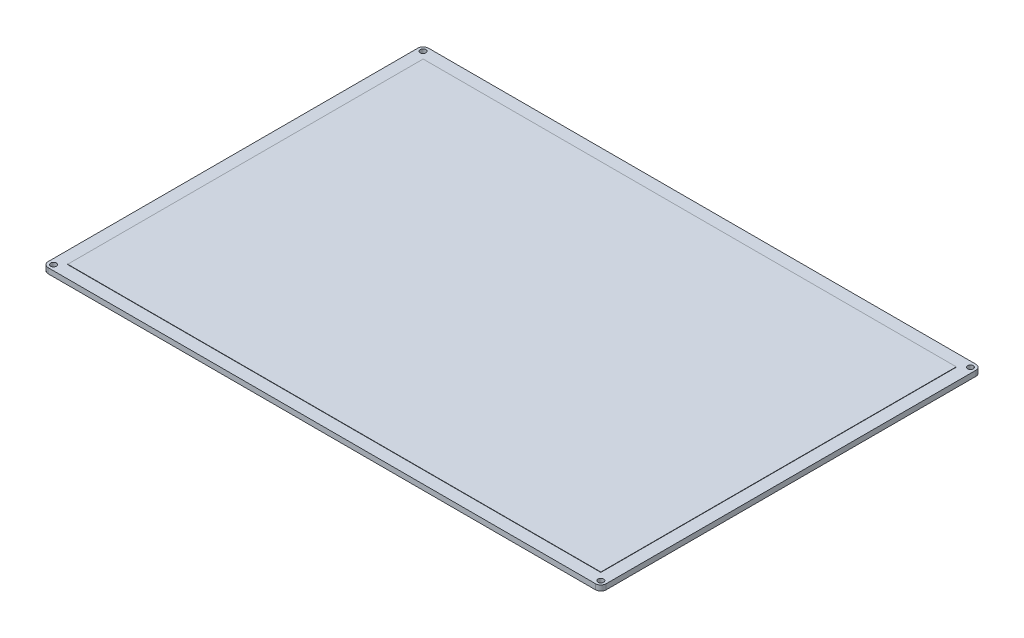
ISO-10303-21;
HEADER;
FILE_DESCRIPTION(('STEP AP214'),'2;1');
FILE_NAME('part.step','',(''),(''),'','','');
FILE_SCHEMA(('AUTOMOTIVE_DESIGN { 1 0 10303 214 1 1 1 1 }'));
ENDSEC;
DATA;
#1=APPLICATION_CONTEXT('core data for automotive mechanical design processes');
#2=APPLICATION_PROTOCOL_DEFINITION('international standard','automotive_design',2000,#1);
#3=PRODUCT_CONTEXT('',#1,'mechanical');
#4=PRODUCT('Part','Part','',(#3));
#5=PRODUCT_RELATED_PRODUCT_CATEGORY('part','',(#4));
#6=PRODUCT_DEFINITION_FORMATION('','',#4);
#7=PRODUCT_DEFINITION_CONTEXT('part definition',#1,'design');
#8=PRODUCT_DEFINITION('design','',#6,#7);
#9=PRODUCT_DEFINITION_SHAPE('','',#8);
#10=(LENGTH_UNIT() NAMED_UNIT(*) SI_UNIT(.MILLI.,.METRE.));
#11=(NAMED_UNIT(*) PLANE_ANGLE_UNIT() SI_UNIT($,.RADIAN.));
#12=(NAMED_UNIT(*) SI_UNIT($,.STERADIAN.) SOLID_ANGLE_UNIT());
#13=UNCERTAINTY_MEASURE_WITH_UNIT(LENGTH_MEASURE(1.E-05),#10,'distance_accuracy_value','');
#14=(GEOMETRIC_REPRESENTATION_CONTEXT(3) GLOBAL_UNCERTAINTY_ASSIGNED_CONTEXT((#13)) GLOBAL_UNIT_ASSIGNED_CONTEXT((#10,
#11,#12)) REPRESENTATION_CONTEXT('',''));
#15=CARTESIAN_POINT('',(0.,0.,0.));
#16=DIRECTION('',(0.,0.,1.));
#17=DIRECTION('',(1.,0.,0.));
#18=AXIS2_PLACEMENT_3D('',#15,#16,#17);
#19=CARTESIAN_POINT('',(157.,0.,107.));
#20=DIRECTION('',(1.,0.,0.));
#21=DIRECTION('',(0.,0.,-1.));
#22=AXIS2_PLACEMENT_3D('',#19,#20,#21);
#23=PLANE('',#22);
#24=DIRECTION('',(0.,0.,-1.));
#25=VECTOR('',#24,1.);
#26=CARTESIAN_POINT('',(157.,3.,107.));
#27=LINE('',#26,#25);
#28=CARTESIAN_POINT('',(157.,3.,104.));
#29=VERTEX_POINT('',#28);
#30=CARTESIAN_POINT('',(157.,3.,-104.));
#31=VERTEX_POINT('',#30);
#32=EDGE_CURVE('E160',#29,#31,#27,.T.);
#33=ORIENTED_EDGE('',*,*,#32,.F.);
#34=DIRECTION('',(0.,1.,0.));
#35=VECTOR('',#34,1.);
#36=CARTESIAN_POINT('',(157.,0.,104.));
#37=LINE('',#36,#35);
#38=CARTESIAN_POINT('',(157.,0.,104.));
#39=VERTEX_POINT('',#38);
#40=EDGE_CURVE('E239',#29,#39,#37,.F.);
#41=ORIENTED_EDGE('',*,*,#40,.T.);
#42=DIRECTION('',(0.,0.,-1.));
#43=VECTOR('',#42,1.);
#44=CARTESIAN_POINT('',(157.,0.,107.));
#45=LINE('',#44,#43);
#46=CARTESIAN_POINT('',(157.,0.,-104.));
#47=VERTEX_POINT('',#46);
#48=EDGE_CURVE('E172',#39,#47,#45,.T.);
#49=ORIENTED_EDGE('',*,*,#48,.T.);
#50=DIRECTION('',(0.,1.,0.));
#51=VECTOR('',#50,1.);
#52=CARTESIAN_POINT('',(157.,0.,-104.));
#53=LINE('',#52,#51);
#54=EDGE_CURVE('E235',#47,#31,#53,.T.);
#55=ORIENTED_EDGE('',*,*,#54,.T.);
#56=EDGE_LOOP('',(#33,#41,#49,#55));
#57=FACE_BOUND('',#56,.T.);
#58=ADVANCED_FACE('F41',(#57),#23,.T.);
#59=CARTESIAN_POINT('',(-157.,0.,107.));
#60=DIRECTION('',(0.,0.,1.));
#61=DIRECTION('',(1.,0.,0.));
#62=AXIS2_PLACEMENT_3D('',#59,#60,#61);
#63=PLANE('',#62);
#64=DIRECTION('',(1.,0.,0.));
#65=VECTOR('',#64,1.);
#66=CARTESIAN_POINT('',(-157.,3.,107.));
#67=LINE('',#66,#65);
#68=CARTESIAN_POINT('',(-154.,3.,107.));
#69=VERTEX_POINT('',#68);
#70=CARTESIAN_POINT('',(154.,3.,107.));
#71=VERTEX_POINT('',#70);
#72=EDGE_CURVE('E177',#69,#71,#67,.T.);
#73=ORIENTED_EDGE('',*,*,#72,.F.);
#74=DIRECTION('',(0.,1.,0.));
#75=VECTOR('',#74,1.);
#76=CARTESIAN_POINT('',(-154.,0.,107.));
#77=LINE('',#76,#75);
#78=CARTESIAN_POINT('',(-154.,0.,107.));
#79=VERTEX_POINT('',#78);
#80=EDGE_CURVE('E221',#69,#79,#77,.F.);
#81=ORIENTED_EDGE('',*,*,#80,.T.);
#82=DIRECTION('',(1.,0.,0.));
#83=VECTOR('',#82,1.);
#84=CARTESIAN_POINT('',(-157.,0.,107.));
#85=LINE('',#84,#83);
#86=CARTESIAN_POINT('',(154.,0.,107.));
#87=VERTEX_POINT('',#86);
#88=EDGE_CURVE('E184',#79,#87,#85,.T.);
#89=ORIENTED_EDGE('',*,*,#88,.T.);
#90=DIRECTION('',(0.,1.,0.));
#91=VECTOR('',#90,1.);
#92=CARTESIAN_POINT('',(154.,0.,107.));
#93=LINE('',#92,#91);
#94=EDGE_CURVE('E217',#87,#71,#93,.T.);
#95=ORIENTED_EDGE('',*,*,#94,.T.);
#96=EDGE_LOOP('',(#73,#81,#89,#95));
#97=FACE_BOUND('',#96,.T.);
#98=ADVANCED_FACE('F300',(#97),#63,.T.);
#99=CARTESIAN_POINT('',(-157.,0.,-107.));
#100=DIRECTION('',(-1.,0.,0.));
#101=DIRECTION('',(0.,0.,1.));
#102=AXIS2_PLACEMENT_3D('',#99,#100,#101);
#103=PLANE('',#102);
#104=DIRECTION('',(0.,0.,1.));
#105=VECTOR('',#104,1.);
#106=CARTESIAN_POINT('',(-157.,0.,-107.));
#107=LINE('',#106,#105);
#108=CARTESIAN_POINT('',(-157.,0.,-104.));
#109=VERTEX_POINT('',#108);
#110=CARTESIAN_POINT('',(-157.,0.,104.));
#111=VERTEX_POINT('',#110);
#112=EDGE_CURVE('E180',#109,#111,#107,.T.);
#113=ORIENTED_EDGE('',*,*,#112,.T.);
#114=DIRECTION('',(0.,1.,0.));
#115=VECTOR('',#114,1.);
#116=CARTESIAN_POINT('',(-157.,0.,104.));
#117=LINE('',#116,#115);
#118=CARTESIAN_POINT('',(-157.,3.,104.));
#119=VERTEX_POINT('',#118);
#120=EDGE_CURVE('E201',#111,#119,#117,.T.);
#121=ORIENTED_EDGE('',*,*,#120,.T.);
#122=DIRECTION('',(0.,0.,1.));
#123=VECTOR('',#122,1.);
#124=CARTESIAN_POINT('',(-157.,3.,-107.));
#125=LINE('',#124,#123);
#126=CARTESIAN_POINT('',(-157.,3.,-104.));
#127=VERTEX_POINT('',#126);
#128=EDGE_CURVE('E192',#127,#119,#125,.T.);
#129=ORIENTED_EDGE('',*,*,#128,.F.);
#130=DIRECTION('',(0.,1.,0.));
#131=VECTOR('',#130,1.);
#132=CARTESIAN_POINT('',(-157.,0.,-104.));
#133=LINE('',#132,#131);
#134=EDGE_CURVE('E187',#127,#109,#133,.F.);
#135=ORIENTED_EDGE('',*,*,#134,.T.);
#136=EDGE_LOOP('',(#113,#121,#129,#135));
#137=FACE_BOUND('',#136,.T.);
#138=ADVANCED_FACE('F281',(#137),#103,.T.);
#139=CARTESIAN_POINT('',(157.,0.,-107.));
#140=DIRECTION('',(0.,0.,-1.));
#141=DIRECTION('',(-1.,0.,0.));
#142=AXIS2_PLACEMENT_3D('',#139,#140,#141);
#143=PLANE('',#142);
#144=DIRECTION('',(-1.,0.,0.));
#145=VECTOR('',#144,1.);
#146=CARTESIAN_POINT('',(157.,0.,-107.));
#147=LINE('',#146,#145);
#148=CARTESIAN_POINT('',(154.,0.,-107.));
#149=VERTEX_POINT('',#148);
#150=CARTESIAN_POINT('',(-154.,0.,-107.));
#151=VERTEX_POINT('',#150);
#152=EDGE_CURVE('E176',#149,#151,#147,.T.);
#153=ORIENTED_EDGE('',*,*,#152,.T.);
#154=DIRECTION('',(0.,1.,0.));
#155=VECTOR('',#154,1.);
#156=CARTESIAN_POINT('',(-154.,0.,-107.));
#157=LINE('',#156,#155);
#158=CARTESIAN_POINT('',(-154.,3.,-107.));
#159=VERTEX_POINT('',#158);
#160=EDGE_CURVE('E11',#151,#159,#157,.T.);
#161=ORIENTED_EDGE('',*,*,#160,.T.);
#162=DIRECTION('',(-1.,0.,0.));
#163=VECTOR('',#162,1.);
#164=CARTESIAN_POINT('',(157.,3.,-107.));
#165=LINE('',#164,#163);
#166=CARTESIAN_POINT('',(154.,3.,-107.));
#167=VERTEX_POINT('',#166);
#168=EDGE_CURVE('E166',#167,#159,#165,.T.);
#169=ORIENTED_EDGE('',*,*,#168,.F.);
#170=DIRECTION('',(0.,1.,0.));
#171=VECTOR('',#170,1.);
#172=CARTESIAN_POINT('',(154.,0.,-107.));
#173=LINE('',#172,#171);
#174=EDGE_CURVE('E50',#167,#149,#173,.F.);
#175=ORIENTED_EDGE('',*,*,#174,.T.);
#176=EDGE_LOOP('',(#153,#161,#169,#175));
#177=FACE_BOUND('',#176,.T.);
#178=ADVANCED_FACE('F286',(#177),#143,.T.);
#179=CARTESIAN_POINT('',(0.,0.,0.));
#180=DIRECTION('',(0.,1.,0.));
#181=DIRECTION('',(0.,0.,1.));
#182=AXIS2_PLACEMENT_3D('',#179,#180,#181);
#183=PLANE('',#182);
#184=CARTESIAN_POINT('',(154.,0.,104.));
#185=DIRECTION('',(0.,1.,0.));
#186=DIRECTION('',(0.,0.,1.));
#187=AXIS2_PLACEMENT_3D('',#184,#185,#186);
#188=CIRCLE('',#187,1.59999999999999);
#189=CARTESIAN_POINT('',(154.,0.,105.6));
#190=VERTEX_POINT('',#189);
#191=EDGE_CURVE('E361',#190,#190,#188,.T.);
#192=ORIENTED_EDGE('',*,*,#191,.T.);
#193=EDGE_LOOP('',(#192));
#194=FACE_BOUND('',#193,.T.);
#195=CARTESIAN_POINT('',(-154.,0.,104.));
#196=DIRECTION('',(0.,1.,0.));
#197=DIRECTION('',(0.,0.,1.));
#198=AXIS2_PLACEMENT_3D('',#195,#196,#197);
#199=CIRCLE('',#198,1.59999999999999);
#200=CARTESIAN_POINT('',(-154.,0.,105.6));
#201=VERTEX_POINT('',#200);
#202=EDGE_CURVE('E355',#201,#201,#199,.T.);
#203=ORIENTED_EDGE('',*,*,#202,.T.);
#204=EDGE_LOOP('',(#203));
#205=FACE_BOUND('',#204,.T.);
#206=CARTESIAN_POINT('',(154.,0.,-104.));
#207=DIRECTION('',(0.,1.,0.));
#208=DIRECTION('',(0.,0.,1.));
#209=AXIS2_PLACEMENT_3D('',#206,#207,#208);
#210=CIRCLE('',#209,1.59999999999999);
#211=CARTESIAN_POINT('',(154.,0.,-102.4));
#212=VERTEX_POINT('',#211);
#213=EDGE_CURVE('E374',#212,#212,#210,.T.);
#214=ORIENTED_EDGE('',*,*,#213,.T.);
#215=EDGE_LOOP('',(#214));
#216=FACE_BOUND('',#215,.T.);
#217=CARTESIAN_POINT('',(-154.,0.,-104.));
#218=DIRECTION('',(0.,1.,0.));
#219=DIRECTION('',(0.,0.,1.));
#220=AXIS2_PLACEMENT_3D('',#217,#218,#219);
#221=CIRCLE('',#220,1.59999999999999);
#222=CARTESIAN_POINT('',(-154.,0.,-102.4));
#223=VERTEX_POINT('',#222);
#224=EDGE_CURVE('E254',#223,#223,#221,.T.);
#225=ORIENTED_EDGE('',*,*,#224,.T.);
#226=EDGE_LOOP('',(#225));
#227=FACE_BOUND('',#226,.T.);
#228=ORIENTED_EDGE('',*,*,#88,.F.);
#229=CARTESIAN_POINT('',(-154.,0.,104.));
#230=DIRECTION('',(0.,1.,0.));
#231=DIRECTION('',(0.,0.,1.));
#232=AXIS2_PLACEMENT_3D('',#229,#230,#231);
#233=CIRCLE('',#232,3.);
#234=EDGE_CURVE('E232',#79,#111,#233,.F.);
#235=ORIENTED_EDGE('',*,*,#234,.T.);
#236=ORIENTED_EDGE('',*,*,#112,.F.);
#237=CARTESIAN_POINT('',(-154.,0.,-104.));
#238=DIRECTION('',(0.,1.,0.));
#239=DIRECTION('',(0.,0.,1.));
#240=AXIS2_PLACEMENT_3D('',#237,#238,#239);
#241=CIRCLE('',#240,3.);
#242=EDGE_CURVE('E57',#109,#151,#241,.F.);
#243=ORIENTED_EDGE('',*,*,#242,.T.);
#244=ORIENTED_EDGE('',*,*,#152,.F.);
#245=CARTESIAN_POINT('',(154.,0.,-104.));
#246=DIRECTION('',(0.,1.,0.));
#247=DIRECTION('',(0.,0.,1.));
#248=AXIS2_PLACEMENT_3D('',#245,#246,#247);
#249=CIRCLE('',#248,3.);
#250=EDGE_CURVE('E224',#149,#47,#249,.F.);
#251=ORIENTED_EDGE('',*,*,#250,.T.);
#252=ORIENTED_EDGE('',*,*,#48,.F.);
#253=CARTESIAN_POINT('',(154.,0.,104.));
#254=DIRECTION('',(0.,1.,0.));
#255=DIRECTION('',(0.,0.,1.));
#256=AXIS2_PLACEMENT_3D('',#253,#254,#255);
#257=CIRCLE('',#256,3.);
#258=EDGE_CURVE('E229',#39,#87,#257,.F.);
#259=ORIENTED_EDGE('',*,*,#258,.T.);
#260=EDGE_LOOP('',(#228,#235,#236,#243,#244,#251,#252,#259));
#261=FACE_BOUND('',#260,.T.);
#262=ADVANCED_FACE('F274',(#194,#205,#216,#227,#261),#183,.F.);
#263=CARTESIAN_POINT('',(0.,3.,0.));
#264=DIRECTION('',(0.,1.,0.));
#265=DIRECTION('',(0.,0.,1.));
#266=AXIS2_PLACEMENT_3D('',#263,#264,#265);
#267=PLANE('',#266);
#268=CARTESIAN_POINT('',(154.,3.,104.));
#269=DIRECTION('',(0.,1.,0.));
#270=DIRECTION('',(0.,0.,1.));
#271=AXIS2_PLACEMENT_3D('',#268,#269,#270);
#272=CIRCLE('',#271,1.59999999999999);
#273=CARTESIAN_POINT('',(154.,3.,105.6));
#274=VERTEX_POINT('',#273);
#275=EDGE_CURVE('E367',#274,#274,#272,.T.);
#276=ORIENTED_EDGE('',*,*,#275,.F.);
#277=EDGE_LOOP('',(#276));
#278=FACE_BOUND('',#277,.T.);
#279=CARTESIAN_POINT('',(-154.,3.,104.));
#280=DIRECTION('',(0.,1.,0.));
#281=DIRECTION('',(0.,0.,1.));
#282=AXIS2_PLACEMENT_3D('',#279,#280,#281);
#283=CIRCLE('',#282,1.59999999999999);
#284=CARTESIAN_POINT('',(-154.,3.,105.6));
#285=VERTEX_POINT('',#284);
#286=EDGE_CURVE('E358',#285,#285,#283,.T.);
#287=ORIENTED_EDGE('',*,*,#286,.F.);
#288=EDGE_LOOP('',(#287));
#289=FACE_BOUND('',#288,.T.);
#290=CARTESIAN_POINT('',(154.,3.,-104.));
#291=DIRECTION('',(0.,1.,0.));
#292=DIRECTION('',(0.,0.,1.));
#293=AXIS2_PLACEMENT_3D('',#290,#291,#292);
#294=CIRCLE('',#293,1.59999999999999);
#295=CARTESIAN_POINT('',(154.,3.,-102.4));
#296=VERTEX_POINT('',#295);
#297=EDGE_CURVE('E364',#296,#296,#294,.T.);
#298=ORIENTED_EDGE('',*,*,#297,.F.);
#299=EDGE_LOOP('',(#298));
#300=FACE_BOUND('',#299,.T.);
#301=CARTESIAN_POINT('',(-154.,3.,-104.));
#302=DIRECTION('',(0.,1.,0.));
#303=DIRECTION('',(0.,0.,1.));
#304=AXIS2_PLACEMENT_3D('',#301,#302,#303);
#305=CIRCLE('',#304,1.59999999999999);
#306=CARTESIAN_POINT('',(-154.,3.,-102.4));
#307=VERTEX_POINT('',#306);
#308=EDGE_CURVE('E378',#307,#307,#305,.T.);
#309=ORIENTED_EDGE('',*,*,#308,.F.);
#310=EDGE_LOOP('',(#309));
#311=FACE_BOUND('',#310,.T.);
#312=DIRECTION('',(0.,0.,1.));
#313=VECTOR('',#312,1.);
#314=CARTESIAN_POINT('',(-150.,3.,100.));
#315=LINE('',#314,#313);
#316=CARTESIAN_POINT('',(-150.,3.,-100.));
#317=VERTEX_POINT('',#316);
#318=CARTESIAN_POINT('',(-150.,3.,100.));
#319=VERTEX_POINT('',#318);
#320=EDGE_CURVE('E158',#317,#319,#315,.T.);
#321=ORIENTED_EDGE('',*,*,#320,.F.);
#322=DIRECTION('',(-1.,0.,0.));
#323=VECTOR('',#322,1.);
#324=CARTESIAN_POINT('',(-150.,3.,-100.));
#325=LINE('',#324,#323);
#326=CARTESIAN_POINT('',(150.,3.,-100.));
#327=VERTEX_POINT('',#326);
#328=EDGE_CURVE('E155',#327,#317,#325,.T.);
#329=ORIENTED_EDGE('',*,*,#328,.F.);
#330=DIRECTION('',(0.,0.,-1.));
#331=VECTOR('',#330,1.);
#332=CARTESIAN_POINT('',(150.,3.,-100.));
#333=LINE('',#332,#331);
#334=CARTESIAN_POINT('',(150.,3.,100.));
#335=VERTEX_POINT('',#334);
#336=EDGE_CURVE('E257',#335,#327,#333,.T.);
#337=ORIENTED_EDGE('',*,*,#336,.F.);
#338=DIRECTION('',(1.,0.,0.));
#339=VECTOR('',#338,1.);
#340=CARTESIAN_POINT('',(150.,3.,100.));
#341=LINE('',#340,#339);
#342=EDGE_CURVE('E253',#319,#335,#341,.T.);
#343=ORIENTED_EDGE('',*,*,#342,.F.);
#344=EDGE_LOOP('',(#321,#329,#337,#343));
#345=FACE_BOUND('',#344,.T.);
#346=ORIENTED_EDGE('',*,*,#128,.T.);
#347=CARTESIAN_POINT('',(-154.,3.,104.));
#348=DIRECTION('',(0.,1.,0.));
#349=DIRECTION('',(0.,0.,1.));
#350=AXIS2_PLACEMENT_3D('',#347,#348,#349);
#351=CIRCLE('',#350,3.);
#352=EDGE_CURVE('E214',#119,#69,#351,.T.);
#353=ORIENTED_EDGE('',*,*,#352,.T.);
#354=ORIENTED_EDGE('',*,*,#72,.T.);
#355=CARTESIAN_POINT('',(154.,3.,104.));
#356=DIRECTION('',(0.,1.,0.));
#357=DIRECTION('',(0.,0.,1.));
#358=AXIS2_PLACEMENT_3D('',#355,#356,#357);
#359=CIRCLE('',#358,3.);
#360=EDGE_CURVE('E211',#71,#29,#359,.T.);
#361=ORIENTED_EDGE('',*,*,#360,.T.);
#362=ORIENTED_EDGE('',*,*,#32,.T.);
#363=CARTESIAN_POINT('',(154.,3.,-104.));
#364=DIRECTION('',(0.,1.,0.));
#365=DIRECTION('',(0.,0.,1.));
#366=AXIS2_PLACEMENT_3D('',#363,#364,#365);
#367=CIRCLE('',#366,3.);
#368=EDGE_CURVE('E205',#31,#167,#367,.T.);
#369=ORIENTED_EDGE('',*,*,#368,.T.);
#370=ORIENTED_EDGE('',*,*,#168,.T.);
#371=CARTESIAN_POINT('',(-154.,3.,-104.));
#372=DIRECTION('',(0.,1.,0.));
#373=DIRECTION('',(0.,0.,1.));
#374=AXIS2_PLACEMENT_3D('',#371,#372,#373);
#375=CIRCLE('',#374,3.);
#376=EDGE_CURVE('E208',#159,#127,#375,.T.);
#377=ORIENTED_EDGE('',*,*,#376,.T.);
#378=EDGE_LOOP('',(#346,#353,#354,#361,#362,#369,#370,#377));
#379=FACE_BOUND('',#378,.T.);
#380=ADVANCED_FACE('F271',(#278,#289,#300,#311,#345,#379),#267,.T.);
#381=CARTESIAN_POINT('',(-150.,3.2,100.));
#382=DIRECTION('',(1.,0.,0.));
#383=DIRECTION('',(0.,0.,-1.));
#384=AXIS2_PLACEMENT_3D('',#381,#382,#383);
#385=PLANE('',#384);
#386=ORIENTED_EDGE('',*,*,#320,.T.);
#387=DIRECTION('',(0.,-1.,0.));
#388=VECTOR('',#387,1.);
#389=CARTESIAN_POINT('',(-150.,3.2,100.));
#390=LINE('',#389,#388);
#391=CARTESIAN_POINT('',(-150.,3.2,100.));
#392=VERTEX_POINT('',#391);
#393=EDGE_CURVE('E137',#392,#319,#390,.T.);
#394=ORIENTED_EDGE('',*,*,#393,.F.);
#395=DIRECTION('',(0.,0.,1.));
#396=VECTOR('',#395,1.);
#397=CARTESIAN_POINT('',(-150.,3.2,100.));
#398=LINE('',#397,#396);
#399=CARTESIAN_POINT('',(-150.,3.2,-100.));
#400=VERTEX_POINT('',#399);
#401=EDGE_CURVE('E145',#400,#392,#398,.T.);
#402=ORIENTED_EDGE('',*,*,#401,.F.);
#403=DIRECTION('',(0.,-1.,0.));
#404=VECTOR('',#403,1.);
#405=CARTESIAN_POINT('',(-150.,3.2,-100.));
#406=LINE('',#405,#404);
#407=EDGE_CURVE('E244',#400,#317,#406,.T.);
#408=ORIENTED_EDGE('',*,*,#407,.T.);
#409=EDGE_LOOP('',(#386,#394,#402,#408));
#410=FACE_BOUND('',#409,.T.);
#411=ADVANCED_FACE('F157',(#410),#385,.F.);
#412=CARTESIAN_POINT('',(150.,3.2,100.));
#413=DIRECTION('',(0.,0.,-1.));
#414=DIRECTION('',(-1.,0.,0.));
#415=AXIS2_PLACEMENT_3D('',#412,#413,#414);
#416=PLANE('',#415);
#417=ORIENTED_EDGE('',*,*,#342,.T.);
#418=DIRECTION('',(0.,-1.,0.));
#419=VECTOR('',#418,1.);
#420=CARTESIAN_POINT('',(150.,3.2,100.));
#421=LINE('',#420,#419);
#422=CARTESIAN_POINT('',(150.,3.2,100.));
#423=VERTEX_POINT('',#422);
#424=EDGE_CURVE('E140',#423,#335,#421,.T.);
#425=ORIENTED_EDGE('',*,*,#424,.F.);
#426=DIRECTION('',(1.,0.,0.));
#427=VECTOR('',#426,1.);
#428=CARTESIAN_POINT('',(150.,3.2,100.));
#429=LINE('',#428,#427);
#430=EDGE_CURVE('E132',#392,#423,#429,.T.);
#431=ORIENTED_EDGE('',*,*,#430,.F.);
#432=ORIENTED_EDGE('',*,*,#393,.T.);
#433=EDGE_LOOP('',(#417,#425,#431,#432));
#434=FACE_BOUND('',#433,.T.);
#435=ADVANCED_FACE('F135',(#434),#416,.F.);
#436=CARTESIAN_POINT('',(150.,3.2,-100.));
#437=DIRECTION('',(-1.,0.,0.));
#438=DIRECTION('',(0.,0.,1.));
#439=AXIS2_PLACEMENT_3D('',#436,#437,#438);
#440=PLANE('',#439);
#441=ORIENTED_EDGE('',*,*,#336,.T.);
#442=DIRECTION('',(0.,-1.,0.));
#443=VECTOR('',#442,1.);
#444=CARTESIAN_POINT('',(150.,3.2,-100.));
#445=LINE('',#444,#443);
#446=CARTESIAN_POINT('',(150.,3.2,-100.));
#447=VERTEX_POINT('',#446);
#448=EDGE_CURVE('E168',#447,#327,#445,.T.);
#449=ORIENTED_EDGE('',*,*,#448,.F.);
#450=DIRECTION('',(0.,0.,-1.));
#451=VECTOR('',#450,1.);
#452=CARTESIAN_POINT('',(150.,3.2,-100.));
#453=LINE('',#452,#451);
#454=EDGE_CURVE('E144',#423,#447,#453,.T.);
#455=ORIENTED_EDGE('',*,*,#454,.F.);
#456=ORIENTED_EDGE('',*,*,#424,.T.);
#457=EDGE_LOOP('',(#441,#449,#455,#456));
#458=FACE_BOUND('',#457,.T.);
#459=ADVANCED_FACE('F269',(#458),#440,.F.);
#460=CARTESIAN_POINT('',(-150.,3.2,-100.));
#461=DIRECTION('',(0.,0.,1.));
#462=DIRECTION('',(1.,0.,0.));
#463=AXIS2_PLACEMENT_3D('',#460,#461,#462);
#464=PLANE('',#463);
#465=ORIENTED_EDGE('',*,*,#328,.T.);
#466=ORIENTED_EDGE('',*,*,#407,.F.);
#467=DIRECTION('',(-1.,0.,0.));
#468=VECTOR('',#467,1.);
#469=CARTESIAN_POINT('',(-150.,3.2,-100.));
#470=LINE('',#469,#468);
#471=EDGE_CURVE('E150',#447,#400,#470,.T.);
#472=ORIENTED_EDGE('',*,*,#471,.F.);
#473=ORIENTED_EDGE('',*,*,#448,.T.);
#474=EDGE_LOOP('',(#465,#466,#472,#473));
#475=FACE_BOUND('',#474,.T.);
#476=ADVANCED_FACE('F267',(#475),#464,.F.);
#477=CARTESIAN_POINT('',(0.,3.2,0.));
#478=DIRECTION('',(0.,-1.,0.));
#479=DIRECTION('',(0.,0.,-1.));
#480=AXIS2_PLACEMENT_3D('',#477,#478,#479);
#481=PLANE('',#480);
#482=ORIENTED_EDGE('',*,*,#401,.T.);
#483=ORIENTED_EDGE('',*,*,#430,.T.);
#484=ORIENTED_EDGE('',*,*,#454,.T.);
#485=ORIENTED_EDGE('',*,*,#471,.T.);
#486=EDGE_LOOP('',(#482,#483,#484,#485));
#487=FACE_BOUND('',#486,.T.);
#488=ADVANCED_FACE('F148',(#487),#481,.F.);
#489=CARTESIAN_POINT('',(-154.,3.,-104.));
#490=DIRECTION('',(0.,1.,0.));
#491=DIRECTION('',(0.,0.,1.));
#492=AXIS2_PLACEMENT_3D('',#489,#490,#491);
#493=CYLINDRICAL_SURFACE('',#492,1.59999999999999);
#494=ORIENTED_EDGE('',*,*,#224,.F.);
#495=EDGE_LOOP('',(#494));
#496=FACE_BOUND('',#495,.T.);
#497=ORIENTED_EDGE('',*,*,#308,.T.);
#498=EDGE_LOOP('',(#497));
#499=FACE_BOUND('',#498,.T.);
#500=ADVANCED_FACE('F340',(#496,#499),#493,.F.);
#501=CARTESIAN_POINT('',(154.,3.,-104.));
#502=DIRECTION('',(0.,1.,0.));
#503=DIRECTION('',(0.,0.,1.));
#504=AXIS2_PLACEMENT_3D('',#501,#502,#503);
#505=CYLINDRICAL_SURFACE('',#504,1.59999999999999);
#506=ORIENTED_EDGE('',*,*,#213,.F.);
#507=EDGE_LOOP('',(#506));
#508=FACE_BOUND('',#507,.T.);
#509=ORIENTED_EDGE('',*,*,#297,.T.);
#510=EDGE_LOOP('',(#509));
#511=FACE_BOUND('',#510,.T.);
#512=ADVANCED_FACE('F343',(#508,#511),#505,.F.);
#513=CARTESIAN_POINT('',(-154.,3.,104.));
#514=DIRECTION('',(0.,1.,0.));
#515=DIRECTION('',(0.,0.,1.));
#516=AXIS2_PLACEMENT_3D('',#513,#514,#515);
#517=CYLINDRICAL_SURFACE('',#516,1.59999999999999);
#518=ORIENTED_EDGE('',*,*,#202,.F.);
#519=EDGE_LOOP('',(#518));
#520=FACE_BOUND('',#519,.T.);
#521=ORIENTED_EDGE('',*,*,#286,.T.);
#522=EDGE_LOOP('',(#521));
#523=FACE_BOUND('',#522,.T.);
#524=ADVANCED_FACE('F313',(#520,#523),#517,.F.);
#525=CARTESIAN_POINT('',(154.,3.,104.));
#526=DIRECTION('',(0.,1.,0.));
#527=DIRECTION('',(0.,0.,1.));
#528=AXIS2_PLACEMENT_3D('',#525,#526,#527);
#529=CYLINDRICAL_SURFACE('',#528,1.59999999999999);
#530=ORIENTED_EDGE('',*,*,#191,.F.);
#531=EDGE_LOOP('',(#530));
#532=FACE_BOUND('',#531,.T.);
#533=ORIENTED_EDGE('',*,*,#275,.T.);
#534=EDGE_LOOP('',(#533));
#535=FACE_BOUND('',#534,.T.);
#536=ADVANCED_FACE('F306',(#532,#535),#529,.F.);
#537=CARTESIAN_POINT('',(-154.,0.,104.));
#538=DIRECTION('',(0.,1.,0.));
#539=DIRECTION('',(0.,0.,1.));
#540=AXIS2_PLACEMENT_3D('',#537,#538,#539);
#541=CYLINDRICAL_SURFACE('',#540,3.);
#542=ORIENTED_EDGE('',*,*,#234,.F.);
#543=ORIENTED_EDGE('',*,*,#80,.F.);
#544=ORIENTED_EDGE('',*,*,#352,.F.);
#545=ORIENTED_EDGE('',*,*,#120,.F.);
#546=EDGE_LOOP('',(#542,#543,#544,#545));
#547=FACE_BOUND('',#546,.T.);
#548=ADVANCED_FACE('F304',(#547),#541,.T.);
#549=CARTESIAN_POINT('',(154.,0.,104.));
#550=DIRECTION('',(0.,1.,0.));
#551=DIRECTION('',(0.,0.,1.));
#552=AXIS2_PLACEMENT_3D('',#549,#550,#551);
#553=CYLINDRICAL_SURFACE('',#552,3.);
#554=ORIENTED_EDGE('',*,*,#258,.F.);
#555=ORIENTED_EDGE('',*,*,#40,.F.);
#556=ORIENTED_EDGE('',*,*,#360,.F.);
#557=ORIENTED_EDGE('',*,*,#94,.F.);
#558=EDGE_LOOP('',(#554,#555,#556,#557));
#559=FACE_BOUND('',#558,.T.);
#560=ADVANCED_FACE('F298',(#559),#553,.T.);
#561=CARTESIAN_POINT('',(-154.,0.,-104.));
#562=DIRECTION('',(0.,1.,0.));
#563=DIRECTION('',(0.,0.,1.));
#564=AXIS2_PLACEMENT_3D('',#561,#562,#563);
#565=CYLINDRICAL_SURFACE('',#564,3.);
#566=ORIENTED_EDGE('',*,*,#242,.F.);
#567=ORIENTED_EDGE('',*,*,#134,.F.);
#568=ORIENTED_EDGE('',*,*,#376,.F.);
#569=ORIENTED_EDGE('',*,*,#160,.F.);
#570=EDGE_LOOP('',(#566,#567,#568,#569));
#571=FACE_BOUND('',#570,.T.);
#572=ADVANCED_FACE('F284',(#571),#565,.T.);
#573=CARTESIAN_POINT('',(154.,0.,-104.));
#574=DIRECTION('',(0.,1.,0.));
#575=DIRECTION('',(0.,0.,1.));
#576=AXIS2_PLACEMENT_3D('',#573,#574,#575);
#577=CYLINDRICAL_SURFACE('',#576,3.);
#578=ORIENTED_EDGE('',*,*,#250,.F.);
#579=ORIENTED_EDGE('',*,*,#174,.F.);
#580=ORIENTED_EDGE('',*,*,#368,.F.);
#581=ORIENTED_EDGE('',*,*,#54,.F.);
#582=EDGE_LOOP('',(#578,#579,#580,#581));
#583=FACE_BOUND('',#582,.T.);
#584=ADVANCED_FACE('F43',(#583),#577,.T.);
#585=CLOSED_SHELL('',(#58,#98,#138,#178,#262,#380,#411,#435,#459,#476,#488,#500,#512,#524,#536,
#548,#560,#572,#584));
#586=MANIFOLD_SOLID_BREP('B2',#585);
#587=ADVANCED_BREP_SHAPE_REPRESENTATION('',(#18,#586),#14);
#588=SHAPE_DEFINITION_REPRESENTATION(#9,#587);
ENDSEC;
END-ISO-10303-21;
